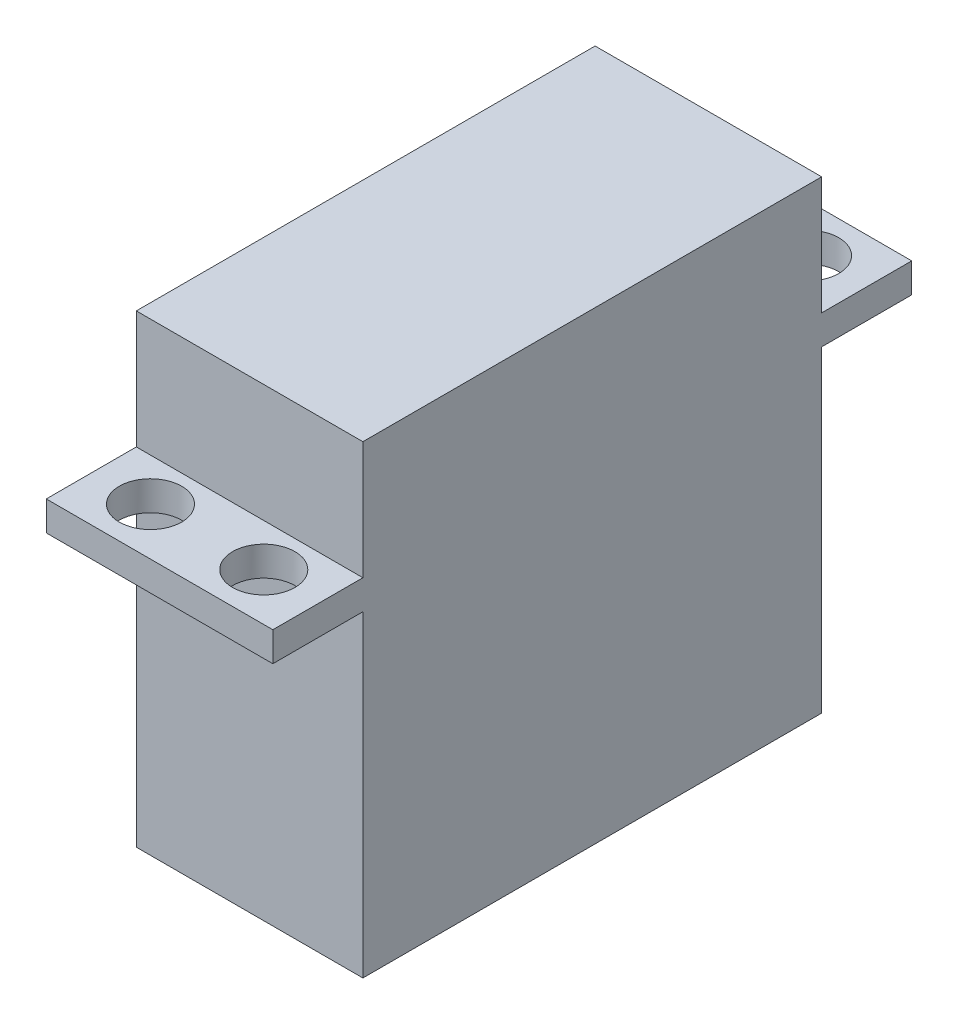
ISO-10303-21;
HEADER;
FILE_DESCRIPTION(('STEP AP214'),'2;1');
FILE_NAME('part.step','',(''),(''),'','','');
FILE_SCHEMA(('AUTOMOTIVE_DESIGN { 1 0 10303 214 1 1 1 1 }'));
ENDSEC;
DATA;
#1=APPLICATION_CONTEXT('core data for automotive mechanical design processes');
#2=APPLICATION_PROTOCOL_DEFINITION('international standard','automotive_design',2000,#1);
#3=PRODUCT_CONTEXT('',#1,'mechanical');
#4=PRODUCT('Part','Part','',(#3));
#5=PRODUCT_RELATED_PRODUCT_CATEGORY('part','',(#4));
#6=PRODUCT_DEFINITION_FORMATION('','',#4);
#7=PRODUCT_DEFINITION_CONTEXT('part definition',#1,'design');
#8=PRODUCT_DEFINITION('design','',#6,#7);
#9=PRODUCT_DEFINITION_SHAPE('','',#8);
#10=(LENGTH_UNIT() NAMED_UNIT(*) SI_UNIT(.MILLI.,.METRE.));
#11=(NAMED_UNIT(*) PLANE_ANGLE_UNIT() SI_UNIT($,.RADIAN.));
#12=(NAMED_UNIT(*) SI_UNIT($,.STERADIAN.) SOLID_ANGLE_UNIT());
#13=UNCERTAINTY_MEASURE_WITH_UNIT(LENGTH_MEASURE(1.E-05),#10,'distance_accuracy_value','');
#14=(GEOMETRIC_REPRESENTATION_CONTEXT(3) GLOBAL_UNCERTAINTY_ASSIGNED_CONTEXT((#13)) GLOBAL_UNIT_ASSIGNED_CONTEXT((#10,
#11,#12)) REPRESENTATION_CONTEXT('',''));
#15=CARTESIAN_POINT('',(0.,0.,0.));
#16=DIRECTION('',(0.,0.,1.));
#17=DIRECTION('',(1.,0.,0.));
#18=AXIS2_PLACEMENT_3D('',#15,#16,#17);
#19=CARTESIAN_POINT('',(-10.,41.,-20.25));
#20=DIRECTION('',(0.,0.,1.));
#21=DIRECTION('',(1.,0.,0.));
#22=AXIS2_PLACEMENT_3D('',#19,#20,#21);
#23=PLANE('',#22);
#24=DIRECTION('',(1.,0.,0.));
#25=VECTOR('',#24,1.);
#26=CARTESIAN_POINT('',(-10.,30.6,-20.25));
#27=LINE('',#26,#25);
#28=CARTESIAN_POINT('',(-10.,30.6,-20.25));
#29=VERTEX_POINT('',#28);
#30=CARTESIAN_POINT('',(10.,30.6,-20.25));
#31=VERTEX_POINT('',#30);
#32=EDGE_CURVE('E135',#29,#31,#27,.T.);
#33=ORIENTED_EDGE('',*,*,#32,.F.);
#34=DIRECTION('',(0.,-1.,0.));
#35=VECTOR('',#34,1.);
#36=CARTESIAN_POINT('',(-10.,41.,-20.25));
#37=LINE('',#36,#35);
#38=CARTESIAN_POINT('',(-10.,41.,-20.25));
#39=VERTEX_POINT('',#38);
#40=EDGE_CURVE('E207',#39,#29,#37,.T.);
#41=ORIENTED_EDGE('',*,*,#40,.F.);
#42=DIRECTION('',(-1.,0.,0.));
#43=VECTOR('',#42,1.);
#44=CARTESIAN_POINT('',(-10.,41.,-20.25));
#45=LINE('',#44,#43);
#46=CARTESIAN_POINT('',(10.,41.,-20.25));
#47=VERTEX_POINT('',#46);
#48=EDGE_CURVE('E172',#47,#39,#45,.T.);
#49=ORIENTED_EDGE('',*,*,#48,.F.);
#50=DIRECTION('',(0.,-1.,0.));
#51=VECTOR('',#50,1.);
#52=CARTESIAN_POINT('',(10.,41.,-20.25));
#53=LINE('',#52,#51);
#54=EDGE_CURVE('E212',#47,#31,#53,.T.);
#55=ORIENTED_EDGE('',*,*,#54,.T.);
#56=EDGE_LOOP('',(#33,#41,#49,#55));
#57=FACE_BOUND('',#56,.T.);
#58=ADVANCED_FACE('F39',(#57),#23,.F.);
#59=CARTESIAN_POINT('',(-10.,41.,20.25));
#60=DIRECTION('',(0.,0.,-1.));
#61=DIRECTION('',(-1.,0.,0.));
#62=AXIS2_PLACEMENT_3D('',#59,#60,#61);
#63=PLANE('',#62);
#64=DIRECTION('',(-1.,0.,0.));
#65=VECTOR('',#64,1.);
#66=CARTESIAN_POINT('',(-10.,30.6,20.25));
#67=LINE('',#66,#65);
#68=CARTESIAN_POINT('',(10.,30.6,20.25));
#69=VERTEX_POINT('',#68);
#70=CARTESIAN_POINT('',(-10.,30.6,20.25));
#71=VERTEX_POINT('',#70);
#72=EDGE_CURVE('E11',#69,#71,#67,.T.);
#73=ORIENTED_EDGE('',*,*,#72,.F.);
#74=DIRECTION('',(0.,-1.,0.));
#75=VECTOR('',#74,1.);
#76=CARTESIAN_POINT('',(10.,41.,20.25));
#77=LINE('',#76,#75);
#78=CARTESIAN_POINT('',(10.,41.,20.25));
#79=VERTEX_POINT('',#78);
#80=EDGE_CURVE('E197',#79,#69,#77,.T.);
#81=ORIENTED_EDGE('',*,*,#80,.F.);
#82=DIRECTION('',(1.,0.,0.));
#83=VECTOR('',#82,1.);
#84=CARTESIAN_POINT('',(-10.,41.,20.25));
#85=LINE('',#84,#83);
#86=CARTESIAN_POINT('',(-10.,41.,20.25));
#87=VERTEX_POINT('',#86);
#88=EDGE_CURVE('E179',#87,#79,#85,.T.);
#89=ORIENTED_EDGE('',*,*,#88,.F.);
#90=DIRECTION('',(0.,-1.,0.));
#91=VECTOR('',#90,1.);
#92=CARTESIAN_POINT('',(-10.,41.,20.25));
#93=LINE('',#92,#91);
#94=EDGE_CURVE('E202',#87,#71,#93,.T.);
#95=ORIENTED_EDGE('',*,*,#94,.T.);
#96=EDGE_LOOP('',(#73,#81,#89,#95));
#97=FACE_BOUND('',#96,.T.);
#98=ADVANCED_FACE('F321',(#97),#63,.F.);
#99=CARTESIAN_POINT('',(10.,41.,20.25));
#100=DIRECTION('',(-1.,0.,0.));
#101=DIRECTION('',(0.,0.,1.));
#102=AXIS2_PLACEMENT_3D('',#99,#100,#101);
#103=PLANE('',#102);
#104=CARTESIAN_POINT('',(10.,28.,-20.25));
#105=VERTEX_POINT('',#104);
#106=CARTESIAN_POINT('',(10.,0.,-20.25));
#107=VERTEX_POINT('',#106);
#108=EDGE_CURVE('E211',#105,#107,#53,.T.);
#109=ORIENTED_EDGE('',*,*,#108,.F.);
#110=DIRECTION('',(0.,0.,-1.));
#111=VECTOR('',#110,1.);
#112=CARTESIAN_POINT('',(10.,28.,28.2));
#113=LINE('',#112,#111);
#114=CARTESIAN_POINT('',(10.,28.,-28.2));
#115=VERTEX_POINT('',#114);
#116=EDGE_CURVE('E57',#105,#115,#113,.T.);
#117=ORIENTED_EDGE('',*,*,#116,.T.);
#118=DIRECTION('',(0.,-1.,0.));
#119=VECTOR('',#118,1.);
#120=CARTESIAN_POINT('',(10.,30.6,-28.2));
#121=LINE('',#120,#119);
#122=CARTESIAN_POINT('',(10.,30.6,-28.2));
#123=VERTEX_POINT('',#122);
#124=EDGE_CURVE('E147',#123,#115,#121,.T.);
#125=ORIENTED_EDGE('',*,*,#124,.F.);
#126=DIRECTION('',(0.,0.,-1.));
#127=VECTOR('',#126,1.);
#128=CARTESIAN_POINT('',(10.,30.6,28.2));
#129=LINE('',#128,#127);
#130=EDGE_CURVE('E129',#31,#123,#129,.T.);
#131=ORIENTED_EDGE('',*,*,#130,.F.);
#132=ORIENTED_EDGE('',*,*,#54,.F.);
#133=DIRECTION('',(0.,0.,-1.));
#134=VECTOR('',#133,1.);
#135=CARTESIAN_POINT('',(10.,41.,20.25));
#136=LINE('',#135,#134);
#137=EDGE_CURVE('E168',#79,#47,#136,.T.);
#138=ORIENTED_EDGE('',*,*,#137,.F.);
#139=ORIENTED_EDGE('',*,*,#80,.T.);
#140=CARTESIAN_POINT('',(10.,30.6,28.2));
#141=VERTEX_POINT('',#140);
#142=EDGE_CURVE('E141',#141,#69,#129,.T.);
#143=ORIENTED_EDGE('',*,*,#142,.F.);
#144=DIRECTION('',(0.,-1.,0.));
#145=VECTOR('',#144,1.);
#146=CARTESIAN_POINT('',(10.,30.6,28.2));
#147=LINE('',#146,#145);
#148=CARTESIAN_POINT('',(10.,28.,28.2));
#149=VERTEX_POINT('',#148);
#150=EDGE_CURVE('E255',#141,#149,#147,.T.);
#151=ORIENTED_EDGE('',*,*,#150,.T.);
#152=CARTESIAN_POINT('',(10.,28.,20.25));
#153=VERTEX_POINT('',#152);
#154=EDGE_CURVE('E256',#149,#153,#113,.T.);
#155=ORIENTED_EDGE('',*,*,#154,.T.);
#156=CARTESIAN_POINT('',(10.,0.,20.25));
#157=VERTEX_POINT('',#156);
#158=EDGE_CURVE('E182',#153,#157,#77,.T.);
#159=ORIENTED_EDGE('',*,*,#158,.T.);
#160=DIRECTION('',(0.,0.,-1.));
#161=VECTOR('',#160,1.);
#162=CARTESIAN_POINT('',(10.,0.,20.25));
#163=LINE('',#162,#161);
#164=EDGE_CURVE('E167',#157,#107,#163,.T.);
#165=ORIENTED_EDGE('',*,*,#164,.T.);
#166=EDGE_LOOP('',(#109,#117,#125,#131,#132,#138,#139,#143,#151,#155,#159,#165));
#167=FACE_BOUND('',#166,.T.);
#168=ADVANCED_FACE('F41',(#167),#103,.F.);
#169=CARTESIAN_POINT('',(-10.,28.,-20.25));
#170=VERTEX_POINT('',#169);
#171=CARTESIAN_POINT('',(-10.,0.,-20.25));
#172=VERTEX_POINT('',#171);
#173=EDGE_CURVE('E206',#170,#172,#37,.T.);
#174=ORIENTED_EDGE('',*,*,#173,.F.);
#175=DIRECTION('',(1.,0.,0.));
#176=VECTOR('',#175,1.);
#177=CARTESIAN_POINT('',(-10.,28.,-20.25));
#178=LINE('',#177,#176);
#179=EDGE_CURVE('E156',#170,#105,#178,.T.);
#180=ORIENTED_EDGE('',*,*,#179,.T.);
#181=ORIENTED_EDGE('',*,*,#108,.T.);
#182=DIRECTION('',(-1.,0.,0.));
#183=VECTOR('',#182,1.);
#184=CARTESIAN_POINT('',(-10.,0.,-20.25));
#185=LINE('',#184,#183);
#186=EDGE_CURVE('E186',#107,#172,#185,.T.);
#187=ORIENTED_EDGE('',*,*,#186,.T.);
#188=EDGE_LOOP('',(#174,#180,#181,#187));
#189=FACE_BOUND('',#188,.T.);
#190=ADVANCED_FACE('F296',(#189),#23,.F.);
#191=CARTESIAN_POINT('',(-10.,41.,20.25));
#192=DIRECTION('',(1.,0.,0.));
#193=DIRECTION('',(0.,0.,-1.));
#194=AXIS2_PLACEMENT_3D('',#191,#192,#193);
#195=PLANE('',#194);
#196=CARTESIAN_POINT('',(-10.,28.,20.25));
#197=VERTEX_POINT('',#196);
#198=CARTESIAN_POINT('',(-10.,0.,20.25));
#199=VERTEX_POINT('',#198);
#200=EDGE_CURVE('E201',#197,#199,#93,.T.);
#201=ORIENTED_EDGE('',*,*,#200,.F.);
#202=DIRECTION('',(0.,0.,1.));
#203=VECTOR('',#202,1.);
#204=CARTESIAN_POINT('',(-10.,28.,28.2));
#205=LINE('',#204,#203);
#206=CARTESIAN_POINT('',(-10.,28.,28.2));
#207=VERTEX_POINT('',#206);
#208=EDGE_CURVE('E65',#197,#207,#205,.T.);
#209=ORIENTED_EDGE('',*,*,#208,.T.);
#210=DIRECTION('',(0.,-1.,0.));
#211=VECTOR('',#210,1.);
#212=CARTESIAN_POINT('',(-10.,30.6,28.2));
#213=LINE('',#212,#211);
#214=CARTESIAN_POINT('',(-10.,30.6,28.2));
#215=VERTEX_POINT('',#214);
#216=EDGE_CURVE('E161',#215,#207,#213,.T.);
#217=ORIENTED_EDGE('',*,*,#216,.F.);
#218=DIRECTION('',(0.,0.,1.));
#219=VECTOR('',#218,1.);
#220=CARTESIAN_POINT('',(-10.,30.6,28.2));
#221=LINE('',#220,#219);
#222=EDGE_CURVE('E152',#71,#215,#221,.T.);
#223=ORIENTED_EDGE('',*,*,#222,.F.);
#224=ORIENTED_EDGE('',*,*,#94,.F.);
#225=DIRECTION('',(0.,0.,1.));
#226=VECTOR('',#225,1.);
#227=CARTESIAN_POINT('',(-10.,41.,20.25));
#228=LINE('',#227,#226);
#229=EDGE_CURVE('E176',#39,#87,#228,.T.);
#230=ORIENTED_EDGE('',*,*,#229,.F.);
#231=ORIENTED_EDGE('',*,*,#40,.T.);
#232=CARTESIAN_POINT('',(-10.,30.6,-28.2));
#233=VERTEX_POINT('',#232);
#234=EDGE_CURVE('E249',#233,#29,#221,.T.);
#235=ORIENTED_EDGE('',*,*,#234,.F.);
#236=DIRECTION('',(0.,-1.,0.));
#237=VECTOR('',#236,1.);
#238=CARTESIAN_POINT('',(-10.,30.6,-28.2));
#239=LINE('',#238,#237);
#240=CARTESIAN_POINT('',(-10.,28.,-28.2));
#241=VERTEX_POINT('',#240);
#242=EDGE_CURVE('E149',#233,#241,#239,.T.);
#243=ORIENTED_EDGE('',*,*,#242,.T.);
#244=EDGE_CURVE('E263',#241,#170,#205,.T.);
#245=ORIENTED_EDGE('',*,*,#244,.T.);
#246=ORIENTED_EDGE('',*,*,#173,.T.);
#247=DIRECTION('',(0.,0.,1.));
#248=VECTOR('',#247,1.);
#249=CARTESIAN_POINT('',(-10.,0.,20.25));
#250=LINE('',#249,#248);
#251=EDGE_CURVE('E190',#172,#199,#250,.T.);
#252=ORIENTED_EDGE('',*,*,#251,.T.);
#253=EDGE_LOOP('',(#201,#209,#217,#223,#224,#230,#231,#235,#243,#245,#246,#252));
#254=FACE_BOUND('',#253,.T.);
#255=ADVANCED_FACE('F300',(#254),#195,.F.);
#256=ORIENTED_EDGE('',*,*,#158,.F.);
#257=DIRECTION('',(-1.,0.,0.));
#258=VECTOR('',#257,1.);
#259=CARTESIAN_POINT('',(-10.,28.,20.25));
#260=LINE('',#259,#258);
#261=EDGE_CURVE('E49',#153,#197,#260,.T.);
#262=ORIENTED_EDGE('',*,*,#261,.T.);
#263=ORIENTED_EDGE('',*,*,#200,.T.);
#264=DIRECTION('',(1.,0.,0.));
#265=VECTOR('',#264,1.);
#266=CARTESIAN_POINT('',(-10.,0.,20.25));
#267=LINE('',#266,#265);
#268=EDGE_CURVE('E173',#199,#157,#267,.T.);
#269=ORIENTED_EDGE('',*,*,#268,.T.);
#270=EDGE_LOOP('',(#256,#262,#263,#269));
#271=FACE_BOUND('',#270,.T.);
#272=ADVANCED_FACE('F285',(#271),#63,.F.);
#273=CARTESIAN_POINT('',(0.,41.,0.));
#274=DIRECTION('',(0.,-1.,0.));
#275=DIRECTION('',(0.,0.,-1.));
#276=AXIS2_PLACEMENT_3D('',#273,#274,#275);
#277=PLANE('',#276);
#278=ORIENTED_EDGE('',*,*,#137,.T.);
#279=ORIENTED_EDGE('',*,*,#48,.T.);
#280=ORIENTED_EDGE('',*,*,#229,.T.);
#281=ORIENTED_EDGE('',*,*,#88,.T.);
#282=EDGE_LOOP('',(#278,#279,#280,#281));
#283=FACE_BOUND('',#282,.T.);
#284=ADVANCED_FACE('F353',(#283),#277,.F.);
#285=CARTESIAN_POINT('',(0.,0.,0.));
#286=DIRECTION('',(0.,-1.,0.));
#287=DIRECTION('',(0.,0.,-1.));
#288=AXIS2_PLACEMENT_3D('',#285,#286,#287);
#289=PLANE('',#288);
#290=ORIENTED_EDGE('',*,*,#164,.F.);
#291=ORIENTED_EDGE('',*,*,#268,.F.);
#292=ORIENTED_EDGE('',*,*,#251,.F.);
#293=ORIENTED_EDGE('',*,*,#186,.F.);
#294=EDGE_LOOP('',(#290,#291,#292,#293));
#295=FACE_BOUND('',#294,.T.);
#296=ADVANCED_FACE('F299',(#295),#289,.T.);
#297=CARTESIAN_POINT('',(-10.,30.6,28.2));
#298=DIRECTION('',(0.,0.,-1.));
#299=DIRECTION('',(-1.,0.,0.));
#300=AXIS2_PLACEMENT_3D('',#297,#298,#299);
#301=PLANE('',#300);
#302=DIRECTION('',(1.,0.,0.));
#303=VECTOR('',#302,1.);
#304=CARTESIAN_POINT('',(-10.,28.,28.2));
#305=LINE('',#304,#303);
#306=EDGE_CURVE('E142',#207,#149,#305,.T.);
#307=ORIENTED_EDGE('',*,*,#306,.T.);
#308=ORIENTED_EDGE('',*,*,#150,.F.);
#309=DIRECTION('',(1.,0.,0.));
#310=VECTOR('',#309,1.);
#311=CARTESIAN_POINT('',(-10.,30.6,28.2));
#312=LINE('',#311,#310);
#313=EDGE_CURVE('E252',#215,#141,#312,.T.);
#314=ORIENTED_EDGE('',*,*,#313,.F.);
#315=ORIENTED_EDGE('',*,*,#216,.T.);
#316=EDGE_LOOP('',(#307,#308,#314,#315));
#317=FACE_BOUND('',#316,.T.);
#318=ADVANCED_FACE('F276',(#317),#301,.F.);
#319=CARTESIAN_POINT('',(0.,28.,0.));
#320=DIRECTION('',(0.,-1.,0.));
#321=DIRECTION('',(0.,0.,-1.));
#322=AXIS2_PLACEMENT_3D('',#319,#320,#321);
#323=PLANE('',#322);
#324=CARTESIAN_POINT('',(5.,28.,24.));
#325=DIRECTION('',(0.,-1.,0.));
#326=DIRECTION('',(0.,0.,-1.));
#327=AXIS2_PLACEMENT_3D('',#324,#325,#326);
#328=CIRCLE('',#327,2.74999999999999);
#329=CARTESIAN_POINT('',(5.,28.,21.25));
#330=VERTEX_POINT('',#329);
#331=EDGE_CURVE('E226',#330,#330,#328,.T.);
#332=ORIENTED_EDGE('',*,*,#331,.F.);
#333=EDGE_LOOP('',(#332));
#334=FACE_BOUND('',#333,.T.);
#335=CARTESIAN_POINT('',(-5.,28.,24.));
#336=DIRECTION('',(0.,-1.,0.));
#337=DIRECTION('',(0.,0.,-1.));
#338=AXIS2_PLACEMENT_3D('',#335,#336,#337);
#339=CIRCLE('',#338,2.74999999999999);
#340=CARTESIAN_POINT('',(-5.,28.,21.25));
#341=VERTEX_POINT('',#340);
#342=EDGE_CURVE('E244',#341,#341,#339,.T.);
#343=ORIENTED_EDGE('',*,*,#342,.F.);
#344=EDGE_LOOP('',(#343));
#345=FACE_BOUND('',#344,.T.);
#346=ORIENTED_EDGE('',*,*,#261,.F.);
#347=ORIENTED_EDGE('',*,*,#154,.F.);
#348=ORIENTED_EDGE('',*,*,#306,.F.);
#349=ORIENTED_EDGE('',*,*,#208,.F.);
#350=EDGE_LOOP('',(#346,#347,#348,#349));
#351=FACE_BOUND('',#350,.T.);
#352=ADVANCED_FACE('F281',(#334,#345,#351),#323,.T.);
#353=CARTESIAN_POINT('',(0.,30.6,0.));
#354=DIRECTION('',(0.,-1.,0.));
#355=DIRECTION('',(0.,0.,-1.));
#356=AXIS2_PLACEMENT_3D('',#353,#354,#355);
#357=PLANE('',#356);
#358=CARTESIAN_POINT('',(5.,30.6,24.));
#359=DIRECTION('',(0.,1.,0.));
#360=DIRECTION('',(0.,0.,1.));
#361=AXIS2_PLACEMENT_3D('',#358,#359,#360);
#362=CIRCLE('',#361,2.75);
#363=CARTESIAN_POINT('',(5.,30.6,26.75));
#364=VERTEX_POINT('',#363);
#365=EDGE_CURVE('E219',#364,#364,#362,.T.);
#366=ORIENTED_EDGE('',*,*,#365,.F.);
#367=EDGE_LOOP('',(#366));
#368=FACE_BOUND('',#367,.T.);
#369=CARTESIAN_POINT('',(-5.,30.6,24.));
#370=DIRECTION('',(0.,1.,0.));
#371=DIRECTION('',(0.,0.,1.));
#372=AXIS2_PLACEMENT_3D('',#369,#370,#371);
#373=CIRCLE('',#372,2.75);
#374=CARTESIAN_POINT('',(-5.,30.6,26.75));
#375=VERTEX_POINT('',#374);
#376=EDGE_CURVE('E240',#375,#375,#373,.T.);
#377=ORIENTED_EDGE('',*,*,#376,.F.);
#378=EDGE_LOOP('',(#377));
#379=FACE_BOUND('',#378,.T.);
#380=ORIENTED_EDGE('',*,*,#142,.T.);
#381=ORIENTED_EDGE('',*,*,#72,.T.);
#382=ORIENTED_EDGE('',*,*,#222,.T.);
#383=ORIENTED_EDGE('',*,*,#313,.T.);
#384=EDGE_LOOP('',(#380,#381,#382,#383));
#385=FACE_BOUND('',#384,.T.);
#386=ADVANCED_FACE('F312',(#368,#379,#385),#357,.F.);
#387=CARTESIAN_POINT('',(-5.,30.6,-24.));
#388=DIRECTION('',(0.,1.,0.));
#389=DIRECTION('',(0.,0.,1.));
#390=AXIS2_PLACEMENT_3D('',#387,#388,#389);
#391=CIRCLE('',#390,2.75);
#392=CARTESIAN_POINT('',(-5.,30.6,-21.25));
#393=VERTEX_POINT('',#392);
#394=EDGE_CURVE('E234',#393,#393,#391,.T.);
#395=ORIENTED_EDGE('',*,*,#394,.F.);
#396=EDGE_LOOP('',(#395));
#397=FACE_BOUND('',#396,.T.);
#398=CARTESIAN_POINT('',(5.,30.6,-24.));
#399=DIRECTION('',(0.,1.,0.));
#400=DIRECTION('',(0.,0.,1.));
#401=AXIS2_PLACEMENT_3D('',#398,#399,#400);
#402=CIRCLE('',#401,2.75);
#403=CARTESIAN_POINT('',(5.,30.6,-21.25));
#404=VERTEX_POINT('',#403);
#405=EDGE_CURVE('E220',#404,#404,#402,.T.);
#406=ORIENTED_EDGE('',*,*,#405,.F.);
#407=EDGE_LOOP('',(#406));
#408=FACE_BOUND('',#407,.T.);
#409=ORIENTED_EDGE('',*,*,#234,.T.);
#410=ORIENTED_EDGE('',*,*,#32,.T.);
#411=ORIENTED_EDGE('',*,*,#130,.T.);
#412=DIRECTION('',(-1.,0.,0.));
#413=VECTOR('',#412,1.);
#414=CARTESIAN_POINT('',(-10.,30.6,-28.2));
#415=LINE('',#414,#413);
#416=EDGE_CURVE('E132',#123,#233,#415,.T.);
#417=ORIENTED_EDGE('',*,*,#416,.T.);
#418=EDGE_LOOP('',(#409,#410,#411,#417));
#419=FACE_BOUND('',#418,.T.);
#420=ADVANCED_FACE('F131',(#397,#408,#419),#357,.F.);
#421=CARTESIAN_POINT('',(-5.,28.,-24.));
#422=DIRECTION('',(0.,-1.,0.));
#423=DIRECTION('',(0.,0.,-1.));
#424=AXIS2_PLACEMENT_3D('',#421,#422,#423);
#425=CIRCLE('',#424,2.74999999999999);
#426=CARTESIAN_POINT('',(-5.,28.,-26.75));
#427=VERTEX_POINT('',#426);
#428=EDGE_CURVE('E43',#427,#427,#425,.T.);
#429=ORIENTED_EDGE('',*,*,#428,.F.);
#430=EDGE_LOOP('',(#429));
#431=FACE_BOUND('',#430,.T.);
#432=CARTESIAN_POINT('',(5.,28.,-24.));
#433=DIRECTION('',(0.,-1.,0.));
#434=DIRECTION('',(0.,0.,-1.));
#435=AXIS2_PLACEMENT_3D('',#432,#433,#434);
#436=CIRCLE('',#435,2.74999999999999);
#437=CARTESIAN_POINT('',(5.,28.,-26.75));
#438=VERTEX_POINT('',#437);
#439=EDGE_CURVE('E216',#438,#438,#436,.T.);
#440=ORIENTED_EDGE('',*,*,#439,.F.);
#441=EDGE_LOOP('',(#440));
#442=FACE_BOUND('',#441,.T.);
#443=ORIENTED_EDGE('',*,*,#179,.F.);
#444=ORIENTED_EDGE('',*,*,#244,.F.);
#445=DIRECTION('',(-1.,0.,0.));
#446=VECTOR('',#445,1.);
#447=CARTESIAN_POINT('',(-10.,28.,-28.2));
#448=LINE('',#447,#446);
#449=EDGE_CURVE('E260',#115,#241,#448,.T.);
#450=ORIENTED_EDGE('',*,*,#449,.F.);
#451=ORIENTED_EDGE('',*,*,#116,.F.);
#452=EDGE_LOOP('',(#443,#444,#450,#451));
#453=FACE_BOUND('',#452,.T.);
#454=ADVANCED_FACE('F302',(#431,#442,#453),#323,.T.);
#455=CARTESIAN_POINT('',(-10.,30.6,-28.2));
#456=DIRECTION('',(0.,0.,1.));
#457=DIRECTION('',(1.,0.,0.));
#458=AXIS2_PLACEMENT_3D('',#455,#456,#457);
#459=PLANE('',#458);
#460=ORIENTED_EDGE('',*,*,#449,.T.);
#461=ORIENTED_EDGE('',*,*,#242,.F.);
#462=ORIENTED_EDGE('',*,*,#416,.F.);
#463=ORIENTED_EDGE('',*,*,#124,.T.);
#464=EDGE_LOOP('',(#460,#461,#462,#463));
#465=FACE_BOUND('',#464,.T.);
#466=ADVANCED_FACE('F146',(#465),#459,.F.);
#467=CARTESIAN_POINT('',(-5.,30.6,24.));
#468=DIRECTION('',(0.,1.,0.));
#469=DIRECTION('',(0.,0.,1.));
#470=AXIS2_PLACEMENT_3D('',#467,#468,#469);
#471=CYLINDRICAL_SURFACE('',#470,2.74999999999999);
#472=ORIENTED_EDGE('',*,*,#342,.T.);
#473=EDGE_LOOP('',(#472));
#474=FACE_BOUND('',#473,.T.);
#475=ORIENTED_EDGE('',*,*,#376,.T.);
#476=EDGE_LOOP('',(#475));
#477=FACE_BOUND('',#476,.T.);
#478=ADVANCED_FACE('F310',(#474,#477),#471,.F.);
#479=CARTESIAN_POINT('',(5.,30.6,24.));
#480=DIRECTION('',(0.,1.,0.));
#481=DIRECTION('',(0.,0.,1.));
#482=AXIS2_PLACEMENT_3D('',#479,#480,#481);
#483=CYLINDRICAL_SURFACE('',#482,2.74999999999999);
#484=ORIENTED_EDGE('',*,*,#331,.T.);
#485=EDGE_LOOP('',(#484));
#486=FACE_BOUND('',#485,.T.);
#487=ORIENTED_EDGE('',*,*,#365,.T.);
#488=EDGE_LOOP('',(#487));
#489=FACE_BOUND('',#488,.T.);
#490=ADVANCED_FACE('F429',(#486,#489),#483,.F.);
#491=CARTESIAN_POINT('',(5.,30.6,-24.));
#492=DIRECTION('',(0.,1.,0.));
#493=DIRECTION('',(0.,0.,1.));
#494=AXIS2_PLACEMENT_3D('',#491,#492,#493);
#495=CYLINDRICAL_SURFACE('',#494,2.74999999999999);
#496=ORIENTED_EDGE('',*,*,#439,.T.);
#497=EDGE_LOOP('',(#496));
#498=FACE_BOUND('',#497,.T.);
#499=ORIENTED_EDGE('',*,*,#405,.T.);
#500=EDGE_LOOP('',(#499));
#501=FACE_BOUND('',#500,.T.);
#502=ADVANCED_FACE('F438',(#498,#501),#495,.F.);
#503=CARTESIAN_POINT('',(-5.,30.6,-24.));
#504=DIRECTION('',(0.,1.,0.));
#505=DIRECTION('',(0.,0.,1.));
#506=AXIS2_PLACEMENT_3D('',#503,#504,#505);
#507=CYLINDRICAL_SURFACE('',#506,2.74999999999999);
#508=ORIENTED_EDGE('',*,*,#428,.T.);
#509=EDGE_LOOP('',(#508));
#510=FACE_BOUND('',#509,.T.);
#511=ORIENTED_EDGE('',*,*,#394,.T.);
#512=EDGE_LOOP('',(#511));
#513=FACE_BOUND('',#512,.T.);
#514=ADVANCED_FACE('F447',(#510,#513),#507,.F.);
#515=CLOSED_SHELL('',(#58,#98,#168,#190,#255,#272,#284,#296,#318,#352,#386,#420,#454,#466,#478,
#490,#502,#514));
#516=MANIFOLD_SOLID_BREP('B2',#515);
#517=ADVANCED_BREP_SHAPE_REPRESENTATION('',(#18,#516),#14);
#518=SHAPE_DEFINITION_REPRESENTATION(#9,#517);
ENDSEC;
END-ISO-10303-21;
